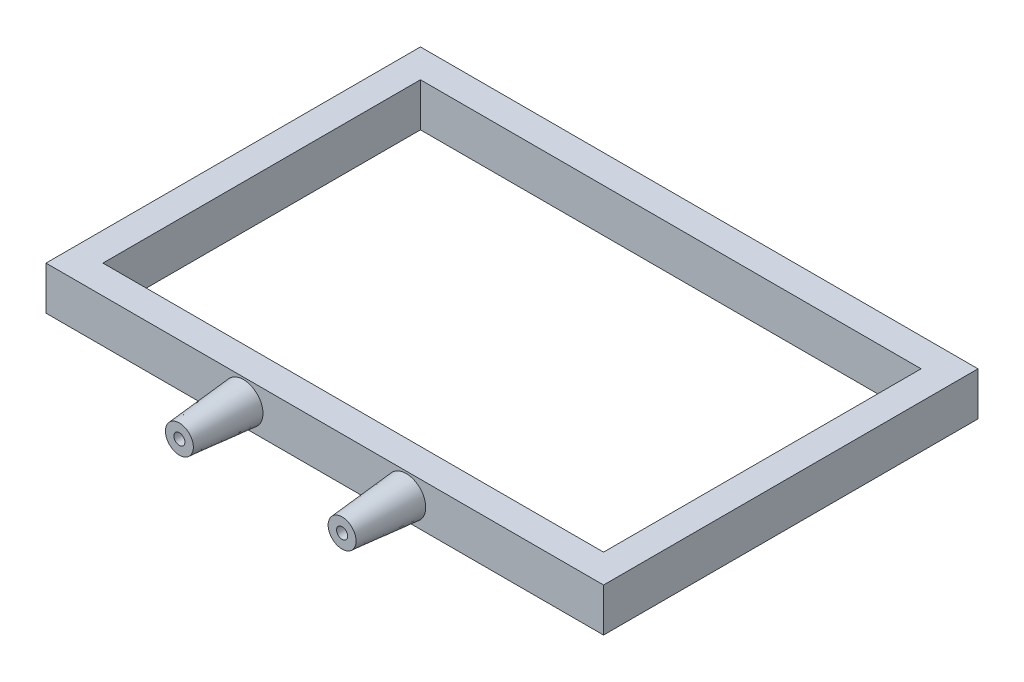
ISO-10303-21;
HEADER;
FILE_DESCRIPTION(('STEP AP214'),'2;1');
FILE_NAME('part.step','',(''),(''),'','','');
FILE_SCHEMA(('AUTOMOTIVE_DESIGN { 1 0 10303 214 1 1 1 1 }'));
ENDSEC;
DATA;
#1=APPLICATION_CONTEXT('core data for automotive mechanical design processes');
#2=APPLICATION_PROTOCOL_DEFINITION('international standard','automotive_design',2000,#1);
#3=PRODUCT_CONTEXT('',#1,'mechanical');
#4=PRODUCT('Part','Part','',(#3));
#5=PRODUCT_RELATED_PRODUCT_CATEGORY('part','',(#4));
#6=PRODUCT_DEFINITION_FORMATION('','',#4);
#7=PRODUCT_DEFINITION_CONTEXT('part definition',#1,'design');
#8=PRODUCT_DEFINITION('design','',#6,#7);
#9=PRODUCT_DEFINITION_SHAPE('','',#8);
#10=(LENGTH_UNIT() NAMED_UNIT(*) SI_UNIT(.MILLI.,.METRE.));
#11=(NAMED_UNIT(*) PLANE_ANGLE_UNIT() SI_UNIT($,.RADIAN.));
#12=(NAMED_UNIT(*) SI_UNIT($,.STERADIAN.) SOLID_ANGLE_UNIT());
#13=UNCERTAINTY_MEASURE_WITH_UNIT(LENGTH_MEASURE(1.E-05),#10,'distance_accuracy_value','');
#14=(GEOMETRIC_REPRESENTATION_CONTEXT(3) GLOBAL_UNCERTAINTY_ASSIGNED_CONTEXT((#13)) GLOBAL_UNIT_ASSIGNED_CONTEXT((#10,
#11,#12)) REPRESENTATION_CONTEXT('',''));
#15=CARTESIAN_POINT('',(0.,0.,0.));
#16=DIRECTION('',(0.,0.,1.));
#17=DIRECTION('',(1.,0.,0.));
#18=AXIS2_PLACEMENT_3D('',#15,#16,#17);
#19=CARTESIAN_POINT('',(-22.8749999999999,6.1,52.6359973136333));
#20=DIRECTION('',(0.,0.,-1.));
#21=DIRECTION('',(1.,0.,0.));
#22=AXIS2_PLACEMENT_3D('',#19,#20,#21);
#23=CONICAL_SURFACE('',#22,5.5,0.0872664625997165);
#24=CARTESIAN_POINT('',(-22.8749999999999,6.1,52.6359973136333));
#25=DIRECTION('',(0.,0.,-1.));
#26=DIRECTION('',(-1.,0.,0.));
#27=AXIS2_PLACEMENT_3D('',#24,#25,#26);
#28=CIRCLE('',#27,5.5);
#29=CARTESIAN_POINT('',(-28.3749999999999,6.1,52.6359973136333));
#30=VERTEX_POINT('',#29);
#31=EDGE_CURVE('E297',#30,#30,#28,.F.);
#32=ORIENTED_EDGE('',*,*,#31,.T.);
#33=EDGE_LOOP('',(#32));
#34=FACE_BOUND('',#33,.T.);
#35=CARTESIAN_POINT('',(-22.8749999999999,6.1,70.6359973136333));
#36=DIRECTION('',(0.,0.,1.));
#37=DIRECTION('',(1.,0.,0.));
#38=AXIS2_PLACEMENT_3D('',#35,#36,#37);
#39=CIRCLE('',#38,3.92520405653336);
#40=CARTESIAN_POINT('',(-18.9497959434666,6.1,70.6359973136333));
#41=VERTEX_POINT('',#40);
#42=EDGE_CURVE('E264',#41,#41,#39,.T.);
#43=ORIENTED_EDGE('',*,*,#42,.F.);
#44=EDGE_LOOP('',(#43));
#45=FACE_BOUND('',#44,.T.);
#46=CARTESIAN_POINT('',(-26.3749999999999,4.17210871809767,69.8285854690584));
#47=CARTESIAN_POINT('',(-26.3749999999999,4.11745942982969,69.5269976381816));
#48=CARTESIAN_POINT('',(-26.3749999999999,4.06446248035971,69.2251163527461));
#49=CARTESIAN_POINT('',(-26.3749999999999,3.96123087004707,68.6208892731655));
#50=CARTESIAN_POINT('',(-26.3749999999999,3.9109961356524,68.3185434916094));
#51=CARTESIAN_POINT('',(-26.3749999999999,3.81274798337831,67.7135200384658));
#52=CARTESIAN_POINT('',(-26.3749999999999,3.76473437277168,67.4108423980156));
#53=CARTESIAN_POINT('',(-26.3749999999999,3.67056684298433,66.8051961446706));
#54=CARTESIAN_POINT('',(-26.3749999999999,3.62441293829521,66.5022275295271));
#55=CARTESIAN_POINT('',(-26.3749999999999,3.48831477248816,65.5930914334059));
#56=CARTESIAN_POINT('',(-26.3749999999999,3.40071471504929,64.9865729981366));
#57=CARTESIAN_POINT('',(-26.3749999999999,3.23016743796715,63.7728702574676));
#58=CARTESIAN_POINT('',(-26.3749999999999,3.14722034779906,63.1656859340175));
#59=CARTESIAN_POINT('',(-26.3749999999999,2.98491601388755,61.950561728038));
#60=CARTESIAN_POINT('',(-26.3749999999999,2.90556039647342,61.3426216288001));
#61=CARTESIAN_POINT('',(-26.3749999999999,2.74975750285684,60.126368515576));
#62=CARTESIAN_POINT('',(-26.3749999999999,2.67331023423791,59.5180555006216));
#63=CARTESIAN_POINT('',(-26.3749999999999,2.44750949646066,57.6926767682325));
#64=CARTESIAN_POINT('',(-26.3749999999999,2.30169733858322,56.4751732114865));
#65=CARTESIAN_POINT('',(-26.3749999999999,2.01663971682371,54.0389161870429));
#66=CARTESIAN_POINT('',(-26.3749999999999,1.87739686896342,52.8201624156162));
#67=CARTESIAN_POINT('',(-26.3749999999999,1.67224553648955,50.9916372554584));
#68=CARTESIAN_POINT('',(-26.3749999999999,1.6044816752983,50.3820732311682));
#69=CARTESIAN_POINT('',(-26.3749999999999,1.47004371275973,49.162826215269));
#70=CARTESIAN_POINT('',(-26.3749999999999,1.40336960922725,48.5531432239012));
#71=CARTESIAN_POINT('',(-26.3749999999999,1.33716672483393,47.9434091582082));
#72=B_SPLINE_CURVE_WITH_KNOTS('',3,(#46,#47,#48,#49,#50,#51,#52,#53,#54,#55,#56,#57,#58,#59,#60,
#61,#62,#63,#64,#65,#66,#67,#68,#69,#70,#71),.UNSPECIFIED.,.F.,.F.,(4,2,2,2,2,2,2,2,2,2,2,2,4),
(0.,0.91948455837307,1.83894462092231,2.75832475157389,3.67771204503739,5.51611992035932,
7.3545789265392,9.19386227997452,11.0331504290127,14.7117323193549,18.3917669342644,
20.2317232111315,22.0716757980903),.UNSPECIFIED.);
#73=CARTESIAN_POINT('',(-26.3749999999999,2.81505393507992,60.6359973136333));
#74=VERTEX_POINT('',#73);
#75=CARTESIAN_POINT('',(-26.3749999999999,2.38189429319995,57.1359973136333));
#76=VERTEX_POINT('',#75);
#77=EDGE_CURVE('E11',#74,#76,#72,.T.);
#78=ORIENTED_EDGE('',*,*,#77,.F.);
#79=CARTESIAN_POINT('',(-22.8749999999999,6.1,60.6359973136333));
#80=DIRECTION('',(0.,0.,-1.));
#81=DIRECTION('',(-1.,0.,0.));
#82=AXIS2_PLACEMENT_3D('',#79,#80,#81);
#83=CIRCLE('',#82,4.8000906917926);
#84=CARTESIAN_POINT('',(-19.3749999999999,2.81505393507991,60.6359973136333));
#85=VERTEX_POINT('',#84);
#86=EDGE_CURVE('E236',#85,#74,#83,.T.);
#87=ORIENTED_EDGE('',*,*,#86,.F.);
#88=CARTESIAN_POINT('',(-19.3749999999999,1.33716672483392,47.9434091582082));
#89=CARTESIAN_POINT('',(-19.3749999999999,1.43500962840932,48.844351854817));
#90=CARTESIAN_POINT('',(-19.3749999999999,1.53384689658539,49.7451881265944));
#91=CARTESIAN_POINT('',(-19.3749999999999,1.73406321961327,51.5465669491305));
#92=CARTESIAN_POINT('',(-19.3749999999999,1.83544224393583,52.4471095032856));
#93=CARTESIAN_POINT('',(-19.3749999999999,2.04127619907767,54.2476556788387));
#94=CARTESIAN_POINT('',(-19.3749999999999,2.14573049022473,55.1476593731346));
#95=CARTESIAN_POINT('',(-19.3749999999999,2.35855843869986,56.9472195360648));
#96=CARTESIAN_POINT('',(-19.3749999999999,2.46693216248866,57.846775996853));
#97=CARTESIAN_POINT('',(-19.3749999999999,2.69205036720925,59.6720549838711));
#98=CARTESIAN_POINT('',(-19.3749999999999,2.80894803278661,60.5977587568576));
#99=CARTESIAN_POINT('',(-19.3749999999999,2.98981211234068,61.9855761544224));
#100=CARTESIAN_POINT('',(-19.3749999999999,3.0510184308723,62.4480494832672));
#101=CARTESIAN_POINT('',(-19.3749999999999,3.17564137614589,63.3727017550615));
#102=CARTESIAN_POINT('',(-19.3749999999999,3.23905801587242,63.8348806962655));
#103=CARTESIAN_POINT('',(-19.3749999999999,3.36858423900071,64.758971624193));
#104=CARTESIAN_POINT('',(-19.3749999999999,3.43469444400984,65.2208835240601));
#105=CARTESIAN_POINT('',(-19.3749999999999,3.57024116419512,66.1442126160202));
#106=CARTESIAN_POINT('',(-19.3749999999999,3.6396776245076,66.6056298161447));
#107=CARTESIAN_POINT('',(-19.3749999999999,3.78280263295804,67.5278740895825));
#108=CARTESIAN_POINT('',(-19.3749999999999,3.85649176054285,67.9887010736904));
#109=CARTESIAN_POINT('',(-19.3749999999999,3.97126229074893,68.6792510157885));
#110=CARTESIAN_POINT('',(-19.3749999999999,4.01022642101928,68.9093256550331));
#111=CARTESIAN_POINT('',(-19.3749999999999,4.08983772132458,69.3691868112572));
#112=CARTESIAN_POINT('',(-19.3749999999999,4.130484916852,69.5989733238181));
#113=CARTESIAN_POINT('',(-19.3749999999999,4.17210871809766,69.8285854690584));
#114=B_SPLINE_CURVE_WITH_KNOTS('',3,(#88,#89,#90,#91,#92,#93,#94,#95,#96,#97,#98,#99,#100,#101,
#102,#103,#104,#105,#106,#107,#108,#109,#110,#111,#112,#113),.UNSPECIFIED.,.F.,.F.,(4,2,2,2,2,2,
2,2,2,2,2,2,4),(0.,2.7187218020045,5.43741096484029,8.15553856620453,10.8737122797325,
13.6728538729671,15.0723675720148,16.4718894939034,17.8717362403286,19.2715599054532,
20.6715747558415,21.3716212738195,22.0716783989049),.UNSPECIFIED.);
#115=CARTESIAN_POINT('',(-19.3749999999999,2.38189429319994,57.1359973136333));
#116=VERTEX_POINT('',#115);
#117=EDGE_CURVE('E51',#116,#85,#114,.T.);
#118=ORIENTED_EDGE('',*,*,#117,.F.);
#119=CARTESIAN_POINT('',(-22.8749999999999,6.1,57.1359973136333));
#120=DIRECTION('',(0.,0.,1.));
#121=DIRECTION('',(1.,0.,0.));
#122=AXIS2_PLACEMENT_3D('',#119,#120,#121);
#123=CIRCLE('',#122,5.10630101413334);
#124=EDGE_CURVE('E233',#76,#116,#123,.T.);
#125=ORIENTED_EDGE('',*,*,#124,.F.);
#126=EDGE_LOOP('',(#78,#87,#118,#125));
#127=FACE_BOUND('',#126,.T.);
#128=ADVANCED_FACE('F37',(#34,#45,#127),#23,.T.);
#129=CARTESIAN_POINT('',(22.875,6.10000000000021,52.6359973136333));
#130=DIRECTION('',(0.,0.,-1.));
#131=DIRECTION('',(-1.,0.,0.));
#132=AXIS2_PLACEMENT_3D('',#129,#130,#131);
#133=CONICAL_SURFACE('',#132,5.5,0.0872664625997165);
#134=CARTESIAN_POINT('',(22.875,6.10000000000021,70.6359973136333));
#135=DIRECTION('',(0.,0.,-1.));
#136=DIRECTION('',(-1.,0.,0.));
#137=AXIS2_PLACEMENT_3D('',#134,#135,#136);
#138=CIRCLE('',#137,3.92520405653336);
#139=CARTESIAN_POINT('',(18.9497959434666,6.10000000000021,70.6359973136333));
#140=VERTEX_POINT('',#139);
#141=EDGE_CURVE('E254',#140,#140,#138,.T.);
#142=ORIENTED_EDGE('',*,*,#141,.T.);
#143=EDGE_LOOP('',(#142));
#144=FACE_BOUND('',#143,.T.);
#145=CARTESIAN_POINT('',(22.875,6.10000000000021,52.6359973136333));
#146=DIRECTION('',(0.,0.,-1.));
#147=DIRECTION('',(-1.,0.,0.));
#148=AXIS2_PLACEMENT_3D('',#145,#146,#147);
#149=CIRCLE('',#148,5.5);
#150=CARTESIAN_POINT('',(17.375,6.10000000000021,52.6359973136333));
#151=VERTEX_POINT('',#150);
#152=EDGE_CURVE('E261',#151,#151,#149,.T.);
#153=ORIENTED_EDGE('',*,*,#152,.F.);
#154=EDGE_LOOP('',(#153));
#155=FACE_BOUND('',#154,.T.);
#156=CARTESIAN_POINT('',(19.3749999999999,1.33716672483419,47.9434091582084));
#157=CARTESIAN_POINT('',(19.3749999999999,1.4350096284096,48.8443518548172));
#158=CARTESIAN_POINT('',(19.3749999999999,1.53384689658566,49.7451881265946));
#159=CARTESIAN_POINT('',(19.3749999999999,1.73406321961355,51.5465669491307));
#160=CARTESIAN_POINT('',(19.3749999999999,1.83544224393611,52.4471095032858));
#161=CARTESIAN_POINT('',(19.3749999999999,2.04127619907795,54.2476556788389));
#162=CARTESIAN_POINT('',(19.3749999999999,2.145730490225,55.1476593731347));
#163=CARTESIAN_POINT('',(19.3749999999999,2.35855843870014,56.9472195360649));
#164=CARTESIAN_POINT('',(19.3749999999999,2.46693216248894,57.8467759968532));
#165=CARTESIAN_POINT('',(19.3749999999999,2.69205036720953,59.6720549838712));
#166=CARTESIAN_POINT('',(19.3749999999999,2.80894803278689,60.5977587568577));
#167=CARTESIAN_POINT('',(19.3749999999999,2.98981211234096,61.9855761544225));
#168=CARTESIAN_POINT('',(19.3749999999999,3.05101843087257,62.4480494832672));
#169=CARTESIAN_POINT('',(19.3749999999999,3.17564137614617,63.3727017550616));
#170=CARTESIAN_POINT('',(19.3749999999999,3.2390580158727,63.8348806962656));
#171=CARTESIAN_POINT('',(19.3749999999999,3.36858423900098,64.758971624193));
#172=CARTESIAN_POINT('',(19.3749999999999,3.43469444401012,65.22088352406));
#173=CARTESIAN_POINT('',(19.3749999999999,3.5702411641954,66.1442126160201));
#174=CARTESIAN_POINT('',(19.3749999999999,3.63967762450788,66.6056298161446));
#175=CARTESIAN_POINT('',(19.3749999999999,3.78280263295832,67.5278740895824));
#176=CARTESIAN_POINT('',(19.3749999999999,3.85649176054313,67.9887010736903));
#177=CARTESIAN_POINT('',(19.3749999999999,3.97126229074921,68.6792510157883));
#178=CARTESIAN_POINT('',(19.3749999999999,4.01022642101956,68.909325655033));
#179=CARTESIAN_POINT('',(19.3749999999999,4.08983772132486,69.369186811257));
#180=CARTESIAN_POINT('',(19.3749999999999,4.13048491685228,69.598973323818));
#181=CARTESIAN_POINT('',(19.3749999999999,4.17210871809794,69.8285854690583));
#182=B_SPLINE_CURVE_WITH_KNOTS('',3,(#156,#157,#158,#159,#160,#161,#162,#163,#164,#165,#166,
#167,#168,#169,#170,#171,#172,#173,#174,#175,#176,#177,#178,#179,#180,#181),.UNSPECIFIED.,.F.,
.F.,(4,2,2,2,2,2,2,2,2,2,2,2,4),(0.,2.7187218020045,5.43741096484028,8.1555385662045,
10.8737122797325,13.672853872967,15.0723675720146,16.4718894939032,17.8717362403284,
19.2715599054529,20.6715747558411,21.3716212738192,22.0716783989045),.UNSPECIFIED.);
#183=CARTESIAN_POINT('',(19.3749999999999,2.3818942932002,57.1359973136333));
#184=VERTEX_POINT('',#183);
#185=CARTESIAN_POINT('',(19.3749999999999,2.81505393508006,60.6359973136334));
#186=VERTEX_POINT('',#185);
#187=EDGE_CURVE('E300',#184,#186,#182,.T.);
#188=ORIENTED_EDGE('',*,*,#187,.T.);
#189=CARTESIAN_POINT('',(22.875,6.10000000000021,60.6359973136333));
#190=DIRECTION('',(0.,0.,-1.));
#191=DIRECTION('',(-1.,0.,0.));
#192=AXIS2_PLACEMENT_3D('',#189,#190,#191);
#193=CIRCLE('',#192,4.8000906917926);
#194=CARTESIAN_POINT('',(26.3749999999999,2.81505393508006,60.6359973136333));
#195=VERTEX_POINT('',#194);
#196=EDGE_CURVE('E243',#186,#195,#193,.F.);
#197=ORIENTED_EDGE('',*,*,#196,.T.);
#198=CARTESIAN_POINT('',(26.3749999999999,4.17210871809775,69.8285854690582));
#199=CARTESIAN_POINT('',(26.3749999999999,4.11745942982977,69.5269976381814));
#200=CARTESIAN_POINT('',(26.3749999999999,4.06446248035979,69.2251163527459));
#201=CARTESIAN_POINT('',(26.3749999999999,3.96123087004716,68.6208892731653));
#202=CARTESIAN_POINT('',(26.3749999999999,3.91099613565249,68.3185434916092));
#203=CARTESIAN_POINT('',(26.3749999999999,3.8127479833784,67.7135200384656));
#204=CARTESIAN_POINT('',(26.3749999999999,3.76473437277178,67.4108423980154));
#205=CARTESIAN_POINT('',(26.3749999999999,3.67056684298443,66.8051961446704));
#206=CARTESIAN_POINT('',(26.3749999999999,3.62441293829532,66.5022275295269));
#207=CARTESIAN_POINT('',(26.3749999999999,3.48831477248826,65.5930914334057));
#208=CARTESIAN_POINT('',(26.3749999999999,3.40071471504939,64.9865729981364));
#209=CARTESIAN_POINT('',(26.3749999999999,3.23016743796727,63.7728702574674));
#210=CARTESIAN_POINT('',(26.3749999999999,3.14722034779917,63.1656859340173));
#211=CARTESIAN_POINT('',(26.3749999999999,2.98491601388767,61.9505617280378));
#212=CARTESIAN_POINT('',(26.3749999999999,2.90556039647355,61.3426216287999));
#213=CARTESIAN_POINT('',(26.3749999999999,2.74975750285697,60.1263685155759));
#214=CARTESIAN_POINT('',(26.3749999999999,2.67331023423804,59.5180555006215));
#215=CARTESIAN_POINT('',(26.3749999999999,2.4475094964608,57.6926767682324));
#216=CARTESIAN_POINT('',(26.3749999999999,2.30169733858338,56.4751732114864));
#217=CARTESIAN_POINT('',(26.3749999999999,2.01663971682388,54.0389161870429));
#218=CARTESIAN_POINT('',(26.3749999999999,1.87739686896359,52.8201624156163));
#219=CARTESIAN_POINT('',(26.3749999999999,1.67224553648973,50.9916372554585));
#220=CARTESIAN_POINT('',(26.3749999999999,1.60448167529848,50.3820732311683));
#221=CARTESIAN_POINT('',(26.3749999999999,1.47004371275992,49.1628262152692));
#222=CARTESIAN_POINT('',(26.3749999999999,1.40336960922744,48.5531432239014));
#223=CARTESIAN_POINT('',(26.3749999999999,1.33716672483412,47.9434091582084));
#224=B_SPLINE_CURVE_WITH_KNOTS('',3,(#198,#199,#200,#201,#202,#203,#204,#205,#206,#207,#208,
#209,#210,#211,#212,#213,#214,#215,#216,#217,#218,#219,#220,#221,#222,#223),.UNSPECIFIED.,.F.,
.F.,(4,2,2,2,2,2,2,2,2,2,2,2,4),(0.,0.919484558373068,1.8389446209223,2.7583247515739,
3.67771204503739,5.51611992035932,7.35457892653922,9.19386227997449,11.0331504290126,
14.7117323193547,18.3917669342641,20.2317232111311,22.0716757980899),.UNSPECIFIED.);
#225=CARTESIAN_POINT('',(26.3749999999999,2.38189429320011,57.1359973136333));
#226=VERTEX_POINT('',#225);
#227=EDGE_CURVE('E317',#195,#226,#224,.T.);
#228=ORIENTED_EDGE('',*,*,#227,.T.);
#229=CARTESIAN_POINT('',(22.875,6.10000000000021,57.1359973136333));
#230=DIRECTION('',(0.,0.,1.));
#231=DIRECTION('',(1.,0.,0.));
#232=AXIS2_PLACEMENT_3D('',#229,#230,#231);
#233=CIRCLE('',#232,5.10630101413334);
#234=EDGE_CURVE('E239',#226,#184,#233,.F.);
#235=ORIENTED_EDGE('',*,*,#234,.T.);
#236=EDGE_LOOP('',(#188,#197,#228,#235));
#237=FACE_BOUND('',#236,.T.);
#238=ADVANCED_FACE('F323',(#144,#155,#237),#133,.T.);
#239=CARTESIAN_POINT('',(22.8750000000001,6.1,70.6369973136333));
#240=DIRECTION('',(0.,0.,-1.));
#241=DIRECTION('',(-1.,0.,0.));
#242=AXIS2_PLACEMENT_3D('',#239,#240,#241);
#243=CYLINDRICAL_SURFACE('',#242,1.55);
#244=CARTESIAN_POINT('',(22.8750000000001,6.1,70.6359973136333));
#245=DIRECTION('',(0.,0.,-1.));
#246=DIRECTION('',(-1.,0.,0.));
#247=AXIS2_PLACEMENT_3D('',#244,#245,#246);
#248=CIRCLE('',#247,1.55);
#249=CARTESIAN_POINT('',(21.3250000000001,6.1,70.6359973136333));
#250=VERTEX_POINT('',#249);
#251=EDGE_CURVE('E246',#250,#250,#248,.T.);
#252=ORIENTED_EDGE('',*,*,#251,.F.);
#253=EDGE_LOOP('',(#252));
#254=FACE_BOUND('',#253,.T.);
#255=CARTESIAN_POINT('',(22.8750000000001,6.1,60.6359973136333));
#256=DIRECTION('',(0.,0.,-1.));
#257=DIRECTION('',(-1.,0.,0.));
#258=AXIS2_PLACEMENT_3D('',#255,#256,#257);
#259=CIRCLE('',#258,1.55);
#260=CARTESIAN_POINT('',(21.3250000000001,6.1,60.6359973136333));
#261=VERTEX_POINT('',#260);
#262=EDGE_CURVE('E242',#261,#261,#259,.T.);
#263=ORIENTED_EDGE('',*,*,#262,.T.);
#264=EDGE_LOOP('',(#263));
#265=FACE_BOUND('',#264,.T.);
#266=ADVANCED_FACE('F355',(#254,#265),#243,.F.);
#267=CARTESIAN_POINT('',(-22.8749999999999,6.1,70.6369973136333));
#268=DIRECTION('',(0.,0.,-1.));
#269=DIRECTION('',(-1.,0.,0.));
#270=AXIS2_PLACEMENT_3D('',#267,#268,#269);
#271=CYLINDRICAL_SURFACE('',#270,1.55);
#272=CARTESIAN_POINT('',(-22.8749999999999,6.1,70.6359973136333));
#273=DIRECTION('',(0.,0.,1.));
#274=DIRECTION('',(1.,0.,0.));
#275=AXIS2_PLACEMENT_3D('',#272,#273,#274);
#276=CIRCLE('',#275,1.55);
#277=CARTESIAN_POINT('',(-21.3249999999999,6.1,70.6359973136333));
#278=VERTEX_POINT('',#277);
#279=EDGE_CURVE('E250',#278,#278,#276,.T.);
#280=ORIENTED_EDGE('',*,*,#279,.T.);
#281=EDGE_LOOP('',(#280));
#282=FACE_BOUND('',#281,.T.);
#283=CARTESIAN_POINT('',(-22.8749999999999,6.1,60.6359973136333));
#284=DIRECTION('',(0.,0.,-1.));
#285=DIRECTION('',(-1.,0.,0.));
#286=AXIS2_PLACEMENT_3D('',#283,#284,#285);
#287=CIRCLE('',#286,1.55);
#288=CARTESIAN_POINT('',(-24.4249999999999,6.1,60.6359973136333));
#289=VERTEX_POINT('',#288);
#290=EDGE_CURVE('E235',#289,#289,#287,.T.);
#291=ORIENTED_EDGE('',*,*,#290,.T.);
#292=EDGE_LOOP('',(#291));
#293=FACE_BOUND('',#292,.T.);
#294=ADVANCED_FACE('F352',(#282,#293),#271,.F.);
#295=CARTESIAN_POINT('',(0.,12.2,0.));
#296=DIRECTION('',(0.,1.,0.));
#297=DIRECTION('',(0.,0.,1.));
#298=AXIS2_PLACEMENT_3D('',#295,#296,#297);
#299=PLANE('',#298);
#300=DIRECTION('',(0.,0.,-1.));
#301=VECTOR('',#300,1.);
#302=CARTESIAN_POINT('',(-70.375,12.2,-44.6359973136333));
#303=LINE('',#302,#301);
#304=CARTESIAN_POINT('',(-70.375,12.2,44.6359973136333));
#305=VERTEX_POINT('',#304);
#306=CARTESIAN_POINT('',(-70.375,12.2,-44.6359973136333));
#307=VERTEX_POINT('',#306);
#308=EDGE_CURVE('E158',#305,#307,#303,.T.);
#309=ORIENTED_EDGE('',*,*,#308,.T.);
#310=DIRECTION('',(1.,0.,0.));
#311=VECTOR('',#310,1.);
#312=CARTESIAN_POINT('',(70.375,12.2,-44.6359973136333));
#313=LINE('',#312,#311);
#314=CARTESIAN_POINT('',(70.375,12.2,-44.6359973136333));
#315=VERTEX_POINT('',#314);
#316=EDGE_CURVE('E167',#307,#315,#313,.T.);
#317=ORIENTED_EDGE('',*,*,#316,.T.);
#318=DIRECTION('',(0.,0.,1.));
#319=VECTOR('',#318,1.);
#320=CARTESIAN_POINT('',(70.375,12.2,-44.6359973136333));
#321=LINE('',#320,#319);
#322=CARTESIAN_POINT('',(70.3749999999999,12.2,44.6359973136333));
#323=VERTEX_POINT('',#322);
#324=EDGE_CURVE('E58',#315,#323,#321,.T.);
#325=ORIENTED_EDGE('',*,*,#324,.T.);
#326=DIRECTION('',(-1.,0.,0.));
#327=VECTOR('',#326,1.);
#328=CARTESIAN_POINT('',(70.3749999999999,12.2,44.6359973136333));
#329=LINE('',#328,#327);
#330=EDGE_CURVE('E164',#323,#305,#329,.T.);
#331=ORIENTED_EDGE('',*,*,#330,.T.);
#332=EDGE_LOOP('',(#309,#317,#325,#331));
#333=FACE_BOUND('',#332,.T.);
#334=DIRECTION('',(0.,0.,-1.));
#335=VECTOR('',#334,1.);
#336=CARTESIAN_POINT('',(78.375,12.2,-52.6359973136333));
#337=LINE('',#336,#335);
#338=CARTESIAN_POINT('',(78.3750000000001,12.2,52.6359973136333));
#339=VERTEX_POINT('',#338);
#340=CARTESIAN_POINT('',(78.375,12.2,-52.6359973136333));
#341=VERTEX_POINT('',#340);
#342=EDGE_CURVE('E268',#339,#341,#337,.T.);
#343=ORIENTED_EDGE('',*,*,#342,.T.);
#344=DIRECTION('',(-1.,0.,0.));
#345=VECTOR('',#344,1.);
#346=CARTESIAN_POINT('',(-78.375,12.2,-52.6359973136333));
#347=LINE('',#346,#345);
#348=CARTESIAN_POINT('',(-78.375,12.2,-52.6359973136333));
#349=VERTEX_POINT('',#348);
#350=EDGE_CURVE('E271',#341,#349,#347,.T.);
#351=ORIENTED_EDGE('',*,*,#350,.T.);
#352=DIRECTION('',(0.,0.,1.));
#353=VECTOR('',#352,1.);
#354=CARTESIAN_POINT('',(-78.375,12.2,-52.6359973136333));
#355=LINE('',#354,#353);
#356=CARTESIAN_POINT('',(-78.3749999999999,12.2,52.6359973136333));
#357=VERTEX_POINT('',#356);
#358=EDGE_CURVE('E274',#349,#357,#355,.T.);
#359=ORIENTED_EDGE('',*,*,#358,.T.);
#360=DIRECTION('',(1.,0.,0.));
#361=VECTOR('',#360,1.);
#362=CARTESIAN_POINT('',(-78.3749999999999,12.2,52.6359973136333));
#363=LINE('',#362,#361);
#364=EDGE_CURVE('E276',#357,#339,#363,.T.);
#365=ORIENTED_EDGE('',*,*,#364,.T.);
#366=EDGE_LOOP('',(#343,#351,#359,#365));
#367=FACE_BOUND('',#366,.T.);
#368=ADVANCED_FACE('F171',(#333,#367),#299,.T.);
#369=CARTESIAN_POINT('',(78.375,12.2,-52.6359973136333));
#370=DIRECTION('',(-1.,0.,0.));
#371=DIRECTION('',(0.,0.,1.));
#372=AXIS2_PLACEMENT_3D('',#369,#370,#371);
#373=PLANE('',#372);
#374=DIRECTION('',(0.,0.,-1.));
#375=VECTOR('',#374,1.);
#376=CARTESIAN_POINT('',(78.375,0.,-52.6359973136333));
#377=LINE('',#376,#375);
#378=CARTESIAN_POINT('',(78.3750000000001,0.,52.6359973136333));
#379=VERTEX_POINT('',#378);
#380=CARTESIAN_POINT('',(78.375,0.,-52.6359973136333));
#381=VERTEX_POINT('',#380);
#382=EDGE_CURVE('E267',#379,#381,#377,.T.);
#383=ORIENTED_EDGE('',*,*,#382,.T.);
#384=DIRECTION('',(0.,-1.,0.));
#385=VECTOR('',#384,1.);
#386=CARTESIAN_POINT('',(78.375,12.2,-52.6359973136333));
#387=LINE('',#386,#385);
#388=EDGE_CURVE('E294',#341,#381,#387,.T.);
#389=ORIENTED_EDGE('',*,*,#388,.F.);
#390=ORIENTED_EDGE('',*,*,#342,.F.);
#391=DIRECTION('',(0.,-1.,0.));
#392=VECTOR('',#391,1.);
#393=CARTESIAN_POINT('',(78.3750000000001,12.2,52.6359973136333));
#394=LINE('',#393,#392);
#395=EDGE_CURVE('E278',#339,#379,#394,.T.);
#396=ORIENTED_EDGE('',*,*,#395,.T.);
#397=EDGE_LOOP('',(#383,#389,#390,#396));
#398=FACE_BOUND('',#397,.T.);
#399=ADVANCED_FACE('F39',(#398),#373,.F.);
#400=CARTESIAN_POINT('',(-78.375,12.2,-52.6359973136333));
#401=DIRECTION('',(0.,0.,1.));
#402=DIRECTION('',(1.,0.,0.));
#403=AXIS2_PLACEMENT_3D('',#400,#401,#402);
#404=PLANE('',#403);
#405=DIRECTION('',(-1.,0.,0.));
#406=VECTOR('',#405,1.);
#407=CARTESIAN_POINT('',(-78.375,0.,-52.6359973136333));
#408=LINE('',#407,#406);
#409=CARTESIAN_POINT('',(-78.375,0.,-52.6359973136333));
#410=VERTEX_POINT('',#409);
#411=EDGE_CURVE('E281',#381,#410,#408,.T.);
#412=ORIENTED_EDGE('',*,*,#411,.T.);
#413=DIRECTION('',(0.,-1.,0.));
#414=VECTOR('',#413,1.);
#415=CARTESIAN_POINT('',(-78.375,12.2,-52.6359973136333));
#416=LINE('',#415,#414);
#417=EDGE_CURVE('E291',#349,#410,#416,.T.);
#418=ORIENTED_EDGE('',*,*,#417,.F.);
#419=ORIENTED_EDGE('',*,*,#350,.F.);
#420=ORIENTED_EDGE('',*,*,#388,.T.);
#421=EDGE_LOOP('',(#412,#418,#419,#420));
#422=FACE_BOUND('',#421,.T.);
#423=ADVANCED_FACE('F464',(#422),#404,.F.);
#424=CARTESIAN_POINT('',(-78.375,12.2,-52.6359973136333));
#425=DIRECTION('',(1.,0.,0.));
#426=DIRECTION('',(0.,0.,-1.));
#427=AXIS2_PLACEMENT_3D('',#424,#425,#426);
#428=PLANE('',#427);
#429=DIRECTION('',(0.,0.,1.));
#430=VECTOR('',#429,1.);
#431=CARTESIAN_POINT('',(-78.375,0.,-52.6359973136333));
#432=LINE('',#431,#430);
#433=CARTESIAN_POINT('',(-78.3749999999999,0.,52.6359973136333));
#434=VERTEX_POINT('',#433);
#435=EDGE_CURVE('E283',#410,#434,#432,.T.);
#436=ORIENTED_EDGE('',*,*,#435,.T.);
#437=DIRECTION('',(0.,-1.,0.));
#438=VECTOR('',#437,1.);
#439=CARTESIAN_POINT('',(-78.3749999999999,12.2,52.6359973136333));
#440=LINE('',#439,#438);
#441=EDGE_CURVE('E288',#357,#434,#440,.T.);
#442=ORIENTED_EDGE('',*,*,#441,.F.);
#443=ORIENTED_EDGE('',*,*,#358,.F.);
#444=ORIENTED_EDGE('',*,*,#417,.T.);
#445=EDGE_LOOP('',(#436,#442,#443,#444));
#446=FACE_BOUND('',#445,.T.);
#447=ADVANCED_FACE('F461',(#446),#428,.F.);
#448=CARTESIAN_POINT('',(-78.3749999999999,12.2,52.6359973136333));
#449=DIRECTION('',(0.,0.,-1.));
#450=DIRECTION('',(-1.,0.,0.));
#451=AXIS2_PLACEMENT_3D('',#448,#449,#450);
#452=PLANE('',#451);
#453=ORIENTED_EDGE('',*,*,#152,.T.);
#454=EDGE_LOOP('',(#453));
#455=FACE_BOUND('',#454,.T.);
#456=ORIENTED_EDGE('',*,*,#31,.F.);
#457=EDGE_LOOP('',(#456));
#458=FACE_BOUND('',#457,.T.);
#459=DIRECTION('',(1.,0.,0.));
#460=VECTOR('',#459,1.);
#461=CARTESIAN_POINT('',(-78.3749999999999,0.,52.6359973136333));
#462=LINE('',#461,#460);
#463=EDGE_CURVE('E272',#434,#379,#462,.T.);
#464=ORIENTED_EDGE('',*,*,#463,.T.);
#465=ORIENTED_EDGE('',*,*,#395,.F.);
#466=ORIENTED_EDGE('',*,*,#364,.F.);
#467=ORIENTED_EDGE('',*,*,#441,.T.);
#468=EDGE_LOOP('',(#464,#465,#466,#467));
#469=FACE_BOUND('',#468,.T.);
#470=ADVANCED_FACE('F448',(#455,#458,#469),#452,.F.);
#471=CARTESIAN_POINT('',(0.,0.,0.));
#472=DIRECTION('',(0.,1.,0.));
#473=DIRECTION('',(0.,0.,1.));
#474=AXIS2_PLACEMENT_3D('',#471,#472,#473);
#475=PLANE('',#474);
#476=DIRECTION('',(1.,0.,0.));
#477=VECTOR('',#476,1.);
#478=CARTESIAN_POINT('',(70.375,0.,-44.6359973136333));
#479=LINE('',#478,#477);
#480=CARTESIAN_POINT('',(-70.375,0.,-44.6359973136333));
#481=VERTEX_POINT('',#480);
#482=CARTESIAN_POINT('',(70.375,0.,-44.6359973136333));
#483=VERTEX_POINT('',#482);
#484=EDGE_CURVE('E183',#481,#483,#479,.T.);
#485=ORIENTED_EDGE('',*,*,#484,.F.);
#486=DIRECTION('',(0.,0.,-1.));
#487=VECTOR('',#486,1.);
#488=CARTESIAN_POINT('',(-70.375,0.,-44.6359973136333));
#489=LINE('',#488,#487);
#490=CARTESIAN_POINT('',(-70.375,0.,44.6359973136333));
#491=VERTEX_POINT('',#490);
#492=EDGE_CURVE('E66',#491,#481,#489,.T.);
#493=ORIENTED_EDGE('',*,*,#492,.F.);
#494=DIRECTION('',(-1.,0.,0.));
#495=VECTOR('',#494,1.);
#496=CARTESIAN_POINT('',(70.3749999999999,0.,44.6359973136333));
#497=LINE('',#496,#495);
#498=CARTESIAN_POINT('',(70.3749999999999,0.,44.6359973136333));
#499=VERTEX_POINT('',#498);
#500=EDGE_CURVE('E174',#499,#491,#497,.T.);
#501=ORIENTED_EDGE('',*,*,#500,.F.);
#502=DIRECTION('',(0.,0.,1.));
#503=VECTOR('',#502,1.);
#504=CARTESIAN_POINT('',(70.375,0.,-44.6359973136333));
#505=LINE('',#504,#503);
#506=EDGE_CURVE('E177',#483,#499,#505,.T.);
#507=ORIENTED_EDGE('',*,*,#506,.F.);
#508=EDGE_LOOP('',(#485,#493,#501,#507));
#509=FACE_BOUND('',#508,.T.);
#510=ORIENTED_EDGE('',*,*,#382,.F.);
#511=ORIENTED_EDGE('',*,*,#463,.F.);
#512=ORIENTED_EDGE('',*,*,#435,.F.);
#513=ORIENTED_EDGE('',*,*,#411,.F.);
#514=EDGE_LOOP('',(#510,#511,#512,#513));
#515=FACE_BOUND('',#514,.T.);
#516=ADVANCED_FACE('F445',(#509,#515),#475,.F.);
#517=CARTESIAN_POINT('',(-22.8749999999999,6.1,70.6359973136333));
#518=DIRECTION('',(0.,0.,1.));
#519=DIRECTION('',(1.,0.,0.));
#520=AXIS2_PLACEMENT_3D('',#517,#518,#519);
#521=PLANE('',#520);
#522=ORIENTED_EDGE('',*,*,#279,.F.);
#523=EDGE_LOOP('',(#522));
#524=FACE_BOUND('',#523,.T.);
#525=ORIENTED_EDGE('',*,*,#42,.T.);
#526=EDGE_LOOP('',(#525));
#527=FACE_BOUND('',#526,.T.);
#528=ADVANCED_FACE('F381',(#524,#527),#521,.T.);
#529=CARTESIAN_POINT('',(22.875,6.10000000000021,70.6359973136333));
#530=DIRECTION('',(0.,0.,-1.));
#531=DIRECTION('',(-1.,0.,0.));
#532=AXIS2_PLACEMENT_3D('',#529,#530,#531);
#533=PLANE('',#532);
#534=ORIENTED_EDGE('',*,*,#251,.T.);
#535=EDGE_LOOP('',(#534));
#536=FACE_BOUND('',#535,.T.);
#537=ORIENTED_EDGE('',*,*,#141,.F.);
#538=EDGE_LOOP('',(#537));
#539=FACE_BOUND('',#538,.T.);
#540=ADVANCED_FACE('F403',(#536,#539),#533,.F.);
#541=CARTESIAN_POINT('',(-26.3749999999999,9.1,60.6359973136333));
#542=DIRECTION('',(1.,0.,0.));
#543=DIRECTION('',(0.,0.,-1.));
#544=AXIS2_PLACEMENT_3D('',#541,#542,#543);
#545=PLANE('',#544);
#546=ORIENTED_EDGE('',*,*,#77,.T.);
#547=DIRECTION('',(0.,-1.,0.));
#548=VECTOR('',#547,1.);
#549=CARTESIAN_POINT('',(-26.3749999999999,9.1,57.1359973136333));
#550=LINE('',#549,#548);
#551=CARTESIAN_POINT('',(-26.3749999999999,9.1,57.1359973136333));
#552=VERTEX_POINT('',#551);
#553=EDGE_CURVE('E203',#552,#76,#550,.T.);
#554=ORIENTED_EDGE('',*,*,#553,.F.);
#555=DIRECTION('',(0.,0.,1.));
#556=VECTOR('',#555,1.);
#557=CARTESIAN_POINT('',(-26.3749999999999,9.1,60.6359973136333));
#558=LINE('',#557,#556);
#559=CARTESIAN_POINT('',(-26.3749999999999,9.1,60.6359973136333));
#560=VERTEX_POINT('',#559);
#561=EDGE_CURVE('E193',#552,#560,#558,.T.);
#562=ORIENTED_EDGE('',*,*,#561,.T.);
#563=DIRECTION('',(0.,-1.,0.));
#564=VECTOR('',#563,1.);
#565=CARTESIAN_POINT('',(-26.3749999999999,9.1,60.6359973136333));
#566=LINE('',#565,#564);
#567=EDGE_CURVE('E211',#560,#74,#566,.T.);
#568=ORIENTED_EDGE('',*,*,#567,.T.);
#569=EDGE_LOOP('',(#546,#554,#562,#568));
#570=FACE_BOUND('',#569,.T.);
#571=ADVANCED_FACE('F395',(#570),#545,.T.);
#572=CARTESIAN_POINT('',(-19.3749999999999,9.1,60.6359973136333));
#573=DIRECTION('',(-1.,0.,0.));
#574=DIRECTION('',(0.,0.,1.));
#575=AXIS2_PLACEMENT_3D('',#572,#573,#574);
#576=PLANE('',#575);
#577=ORIENTED_EDGE('',*,*,#117,.T.);
#578=DIRECTION('',(0.,-1.,0.));
#579=VECTOR('',#578,1.);
#580=CARTESIAN_POINT('',(-19.3749999999999,9.1,60.6359973136333));
#581=LINE('',#580,#579);
#582=CARTESIAN_POINT('',(-19.3749999999999,9.1,60.6359973136333));
#583=VERTEX_POINT('',#582);
#584=EDGE_CURVE('E208',#583,#85,#581,.T.);
#585=ORIENTED_EDGE('',*,*,#584,.F.);
#586=DIRECTION('',(0.,0.,-1.));
#587=VECTOR('',#586,1.);
#588=CARTESIAN_POINT('',(-19.3749999999999,9.1,60.6359973136333));
#589=LINE('',#588,#587);
#590=CARTESIAN_POINT('',(-19.3749999999999,9.1,57.1359973136333));
#591=VERTEX_POINT('',#590);
#592=EDGE_CURVE('E199',#583,#591,#589,.T.);
#593=ORIENTED_EDGE('',*,*,#592,.T.);
#594=DIRECTION('',(0.,-1.,0.));
#595=VECTOR('',#594,1.);
#596=CARTESIAN_POINT('',(-19.3749999999999,9.1,57.1359973136333));
#597=LINE('',#596,#595);
#598=EDGE_CURVE('E205',#591,#116,#597,.T.);
#599=ORIENTED_EDGE('',*,*,#598,.T.);
#600=EDGE_LOOP('',(#577,#585,#593,#599));
#601=FACE_BOUND('',#600,.T.);
#602=ADVANCED_FACE('F389',(#601),#576,.T.);
#603=CARTESIAN_POINT('',(-26.3749999999999,9.1,60.6359973136333));
#604=DIRECTION('',(0.,0.,-1.));
#605=DIRECTION('',(-1.,0.,0.));
#606=AXIS2_PLACEMENT_3D('',#603,#604,#605);
#607=PLANE('',#606);
#608=ORIENTED_EDGE('',*,*,#290,.F.);
#609=EDGE_LOOP('',(#608));
#610=FACE_BOUND('',#609,.T.);
#611=ORIENTED_EDGE('',*,*,#86,.T.);
#612=ORIENTED_EDGE('',*,*,#567,.F.);
#613=DIRECTION('',(1.,0.,0.));
#614=VECTOR('',#613,1.);
#615=CARTESIAN_POINT('',(-26.3749999999999,9.1,60.6359973136333));
#616=LINE('',#615,#614);
#617=EDGE_CURVE('E196',#560,#583,#616,.T.);
#618=ORIENTED_EDGE('',*,*,#617,.T.);
#619=ORIENTED_EDGE('',*,*,#584,.T.);
#620=EDGE_LOOP('',(#611,#612,#618,#619));
#621=FACE_BOUND('',#620,.T.);
#622=ADVANCED_FACE('F394',(#610,#621),#607,.T.);
#623=CARTESIAN_POINT('',(-26.3749999999999,9.1,57.1359973136333));
#624=DIRECTION('',(0.,0.,1.));
#625=DIRECTION('',(1.,0.,0.));
#626=AXIS2_PLACEMENT_3D('',#623,#624,#625);
#627=PLANE('',#626);
#628=CARTESIAN_POINT('',(-22.8749999999999,6.1,57.1359973136333));
#629=DIRECTION('',(0.,0.,1.));
#630=DIRECTION('',(1.,0.,0.));
#631=AXIS2_PLACEMENT_3D('',#628,#629,#630);
#632=CIRCLE('',#631,1.55);
#633=CARTESIAN_POINT('',(-21.3249999999999,6.1,57.1359973136333));
#634=VERTEX_POINT('',#633);
#635=EDGE_CURVE('E214',#634,#634,#632,.T.);
#636=ORIENTED_EDGE('',*,*,#635,.F.);
#637=EDGE_LOOP('',(#636));
#638=FACE_BOUND('',#637,.T.);
#639=ORIENTED_EDGE('',*,*,#124,.T.);
#640=ORIENTED_EDGE('',*,*,#598,.F.);
#641=DIRECTION('',(-1.,0.,0.));
#642=VECTOR('',#641,1.);
#643=CARTESIAN_POINT('',(-26.3749999999999,9.1,57.1359973136333));
#644=LINE('',#643,#642);
#645=EDGE_CURVE('E201',#591,#552,#644,.T.);
#646=ORIENTED_EDGE('',*,*,#645,.T.);
#647=ORIENTED_EDGE('',*,*,#553,.T.);
#648=EDGE_LOOP('',(#639,#640,#646,#647));
#649=FACE_BOUND('',#648,.T.);
#650=ADVANCED_FACE('F397',(#638,#649),#627,.T.);
#651=CARTESIAN_POINT('',(0.,9.1,0.));
#652=DIRECTION('',(0.,-1.,0.));
#653=DIRECTION('',(0.,0.,-1.));
#654=AXIS2_PLACEMENT_3D('',#651,#652,#653);
#655=PLANE('',#654);
#656=ORIENTED_EDGE('',*,*,#561,.F.);
#657=ORIENTED_EDGE('',*,*,#645,.F.);
#658=ORIENTED_EDGE('',*,*,#592,.F.);
#659=ORIENTED_EDGE('',*,*,#617,.F.);
#660=EDGE_LOOP('',(#656,#657,#658,#659));
#661=FACE_BOUND('',#660,.T.);
#662=ADVANCED_FACE('F345',(#661),#655,.T.);
#663=CARTESIAN_POINT('',(26.3749999999999,9.1,60.6359973136333));
#664=DIRECTION('',(0.,0.,-1.));
#665=DIRECTION('',(-1.,0.,0.));
#666=AXIS2_PLACEMENT_3D('',#663,#664,#665);
#667=PLANE('',#666);
#668=ORIENTED_EDGE('',*,*,#262,.F.);
#669=EDGE_LOOP('',(#668));
#670=FACE_BOUND('',#669,.T.);
#671=DIRECTION('',(0.,-1.,0.));
#672=VECTOR('',#671,1.);
#673=CARTESIAN_POINT('',(19.3749999999999,9.1,60.6359973136333));
#674=LINE('',#673,#672);
#675=CARTESIAN_POINT('',(19.3749999999999,9.1,60.6359973136333));
#676=VERTEX_POINT('',#675);
#677=EDGE_CURVE('E223',#676,#186,#674,.T.);
#678=ORIENTED_EDGE('',*,*,#677,.F.);
#679=DIRECTION('',(1.,0.,0.));
#680=VECTOR('',#679,1.);
#681=CARTESIAN_POINT('',(26.3749999999999,9.1,60.6359973136333));
#682=LINE('',#681,#680);
#683=CARTESIAN_POINT('',(26.3749999999999,9.1,60.6359973136333));
#684=VERTEX_POINT('',#683);
#685=EDGE_CURVE('E189',#676,#684,#682,.T.);
#686=ORIENTED_EDGE('',*,*,#685,.T.);
#687=DIRECTION('',(0.,-1.,0.));
#688=VECTOR('',#687,1.);
#689=CARTESIAN_POINT('',(26.3749999999999,9.1,60.6359973136333));
#690=LINE('',#689,#688);
#691=EDGE_CURVE('E197',#684,#195,#690,.T.);
#692=ORIENTED_EDGE('',*,*,#691,.T.);
#693=ORIENTED_EDGE('',*,*,#196,.F.);
#694=EDGE_LOOP('',(#678,#686,#692,#693));
#695=FACE_BOUND('',#694,.T.);
#696=ADVANCED_FACE('F341',(#670,#695),#667,.T.);
#697=CARTESIAN_POINT('',(26.3749999999999,9.1,60.6359973136333));
#698=DIRECTION('',(-1.,0.,0.));
#699=DIRECTION('',(0.,0.,1.));
#700=AXIS2_PLACEMENT_3D('',#697,#698,#699);
#701=PLANE('',#700);
#702=ORIENTED_EDGE('',*,*,#691,.F.);
#703=DIRECTION('',(0.,0.,-1.));
#704=VECTOR('',#703,1.);
#705=CARTESIAN_POINT('',(26.3749999999999,9.1,60.6359973136333));
#706=LINE('',#705,#704);
#707=CARTESIAN_POINT('',(26.3749999999999,9.1,57.1359973136333));
#708=VERTEX_POINT('',#707);
#709=EDGE_CURVE('E217',#684,#708,#706,.T.);
#710=ORIENTED_EDGE('',*,*,#709,.T.);
#711=DIRECTION('',(0.,-1.,0.));
#712=VECTOR('',#711,1.);
#713=CARTESIAN_POINT('',(26.3749999999999,9.1,57.1359973136333));
#714=LINE('',#713,#712);
#715=EDGE_CURVE('E228',#708,#226,#714,.T.);
#716=ORIENTED_EDGE('',*,*,#715,.T.);
#717=ORIENTED_EDGE('',*,*,#227,.F.);
#718=EDGE_LOOP('',(#702,#710,#716,#717));
#719=FACE_BOUND('',#718,.T.);
#720=ADVANCED_FACE('F336',(#719),#701,.T.);
#721=CARTESIAN_POINT('',(26.3749999999999,9.1,57.1359973136333));
#722=DIRECTION('',(0.,0.,1.));
#723=DIRECTION('',(1.,0.,0.));
#724=AXIS2_PLACEMENT_3D('',#721,#722,#723);
#725=PLANE('',#724);
#726=CARTESIAN_POINT('',(22.8750000000001,6.1,57.1359973136333));
#727=DIRECTION('',(0.,0.,1.));
#728=DIRECTION('',(1.,0.,0.));
#729=AXIS2_PLACEMENT_3D('',#726,#727,#728);
#730=CIRCLE('',#729,1.55);
#731=CARTESIAN_POINT('',(24.4250000000001,6.1,57.1359973136333));
#732=VERTEX_POINT('',#731);
#733=EDGE_CURVE('E238',#732,#732,#730,.T.);
#734=ORIENTED_EDGE('',*,*,#733,.F.);
#735=EDGE_LOOP('',(#734));
#736=FACE_BOUND('',#735,.T.);
#737=ORIENTED_EDGE('',*,*,#715,.F.);
#738=DIRECTION('',(-1.,0.,0.));
#739=VECTOR('',#738,1.);
#740=CARTESIAN_POINT('',(26.3749999999999,9.1,57.1359973136333));
#741=LINE('',#740,#739);
#742=CARTESIAN_POINT('',(19.3749999999999,9.1,57.1359973136333));
#743=VERTEX_POINT('',#742);
#744=EDGE_CURVE('E219',#708,#743,#741,.T.);
#745=ORIENTED_EDGE('',*,*,#744,.T.);
#746=DIRECTION('',(0.,-1.,0.));
#747=VECTOR('',#746,1.);
#748=CARTESIAN_POINT('',(19.3749999999999,9.1,57.1359973136333));
#749=LINE('',#748,#747);
#750=EDGE_CURVE('E225',#743,#184,#749,.T.);
#751=ORIENTED_EDGE('',*,*,#750,.T.);
#752=ORIENTED_EDGE('',*,*,#234,.F.);
#753=EDGE_LOOP('',(#737,#745,#751,#752));
#754=FACE_BOUND('',#753,.T.);
#755=ADVANCED_FACE('F333',(#736,#754),#725,.T.);
#756=CARTESIAN_POINT('',(19.3749999999999,9.1,60.6359973136333));
#757=DIRECTION('',(1.,0.,0.));
#758=DIRECTION('',(0.,0.,-1.));
#759=AXIS2_PLACEMENT_3D('',#756,#757,#758);
#760=PLANE('',#759);
#761=ORIENTED_EDGE('',*,*,#750,.F.);
#762=DIRECTION('',(0.,0.,1.));
#763=VECTOR('',#762,1.);
#764=CARTESIAN_POINT('',(19.3749999999999,9.1,60.6359973136333));
#765=LINE('',#764,#763);
#766=EDGE_CURVE('E221',#743,#676,#765,.T.);
#767=ORIENTED_EDGE('',*,*,#766,.T.);
#768=ORIENTED_EDGE('',*,*,#677,.T.);
#769=ORIENTED_EDGE('',*,*,#187,.F.);
#770=EDGE_LOOP('',(#761,#767,#768,#769));
#771=FACE_BOUND('',#770,.T.);
#772=ADVANCED_FACE('F327',(#771),#760,.T.);
#773=CARTESIAN_POINT('',(0.,9.1,0.));
#774=DIRECTION('',(0.,-1.,0.));
#775=DIRECTION('',(0.,0.,-1.));
#776=AXIS2_PLACEMENT_3D('',#773,#774,#775);
#777=PLANE('',#776);
#778=ORIENTED_EDGE('',*,*,#685,.F.);
#779=ORIENTED_EDGE('',*,*,#766,.F.);
#780=ORIENTED_EDGE('',*,*,#744,.F.);
#781=ORIENTED_EDGE('',*,*,#709,.F.);
#782=EDGE_LOOP('',(#778,#779,#780,#781));
#783=FACE_BOUND('',#782,.T.);
#784=ADVANCED_FACE('F332',(#783),#777,.T.);
#785=CARTESIAN_POINT('',(-22.8749999999999,6.1,52.6359973136333));
#786=DIRECTION('',(0.,0.,1.));
#787=DIRECTION('',(1.,0.,0.));
#788=AXIS2_PLACEMENT_3D('',#785,#786,#787);
#789=PLANE('',#788);
#790=CARTESIAN_POINT('',(-22.8749999999999,6.1,52.6359973136333));
#791=DIRECTION('',(0.,0.,1.));
#792=DIRECTION('',(1.,0.,0.));
#793=AXIS2_PLACEMENT_3D('',#790,#791,#792);
#794=CIRCLE('',#793,1.55);
#795=CARTESIAN_POINT('',(-21.3249999999999,6.1,52.6359973136333));
#796=VERTEX_POINT('',#795);
#797=EDGE_CURVE('E247',#796,#796,#794,.T.);
#798=ORIENTED_EDGE('',*,*,#797,.T.);
#799=EDGE_LOOP('',(#798));
#800=FACE_BOUND('',#799,.T.);
#801=ADVANCED_FACE('F347',(#800),#789,.T.);
#802=ORIENTED_EDGE('',*,*,#797,.F.);
#803=EDGE_LOOP('',(#802));
#804=FACE_BOUND('',#803,.T.);
#805=ORIENTED_EDGE('',*,*,#635,.T.);
#806=EDGE_LOOP('',(#805));
#807=FACE_BOUND('',#806,.T.);
#808=ADVANCED_FACE('F350',(#804,#807),#271,.F.);
#809=CARTESIAN_POINT('',(22.8750000000001,6.1,52.6359973136333));
#810=DIRECTION('',(0.,0.,-1.));
#811=DIRECTION('',(-1.,0.,0.));
#812=AXIS2_PLACEMENT_3D('',#809,#810,#811);
#813=PLANE('',#812);
#814=CARTESIAN_POINT('',(22.8750000000001,6.1,52.6359973136333));
#815=DIRECTION('',(0.,0.,1.));
#816=DIRECTION('',(-1.,0.,0.));
#817=AXIS2_PLACEMENT_3D('',#814,#815,#816);
#818=CIRCLE('',#817,1.55);
#819=CARTESIAN_POINT('',(21.3250000000001,6.1,52.6359973136333));
#820=VERTEX_POINT('',#819);
#821=EDGE_CURVE('E251',#820,#820,#818,.T.);
#822=ORIENTED_EDGE('',*,*,#821,.T.);
#823=EDGE_LOOP('',(#822));
#824=FACE_BOUND('',#823,.T.);
#825=ADVANCED_FACE('F357',(#824),#813,.F.);
#826=ORIENTED_EDGE('',*,*,#821,.F.);
#827=EDGE_LOOP('',(#826));
#828=FACE_BOUND('',#827,.T.);
#829=ORIENTED_EDGE('',*,*,#733,.T.);
#830=EDGE_LOOP('',(#829));
#831=FACE_BOUND('',#830,.T.);
#832=ADVANCED_FACE('F359',(#828,#831),#243,.F.);
#833=CARTESIAN_POINT('',(-70.375,12.2,-44.6359973136333));
#834=DIRECTION('',(-1.,0.,0.));
#835=DIRECTION('',(0.,0.,1.));
#836=AXIS2_PLACEMENT_3D('',#833,#834,#835);
#837=PLANE('',#836);
#838=ORIENTED_EDGE('',*,*,#492,.T.);
#839=DIRECTION('',(0.,-1.,0.));
#840=VECTOR('',#839,1.);
#841=CARTESIAN_POINT('',(-70.375,12.2,-44.6359973136333));
#842=LINE('',#841,#840);
#843=EDGE_CURVE('E154',#307,#481,#842,.T.);
#844=ORIENTED_EDGE('',*,*,#843,.F.);
#845=ORIENTED_EDGE('',*,*,#308,.F.);
#846=DIRECTION('',(0.,-1.,0.));
#847=VECTOR('',#846,1.);
#848=CARTESIAN_POINT('',(-70.375,12.2,44.6359973136333));
#849=LINE('',#848,#847);
#850=EDGE_CURVE('E187',#305,#491,#849,.T.);
#851=ORIENTED_EDGE('',*,*,#850,.T.);
#852=EDGE_LOOP('',(#838,#844,#845,#851));
#853=FACE_BOUND('',#852,.T.);
#854=ADVANCED_FACE('F156',(#853),#837,.F.);
#855=CARTESIAN_POINT('',(70.3749999999999,12.2,44.6359973136333));
#856=DIRECTION('',(0.,0.,1.));
#857=DIRECTION('',(1.,0.,0.));
#858=AXIS2_PLACEMENT_3D('',#855,#856,#857);
#859=PLANE('',#858);
#860=ORIENTED_EDGE('',*,*,#500,.T.);
#861=ORIENTED_EDGE('',*,*,#850,.F.);
#862=ORIENTED_EDGE('',*,*,#330,.F.);
#863=DIRECTION('',(0.,-1.,0.));
#864=VECTOR('',#863,1.);
#865=CARTESIAN_POINT('',(70.3749999999999,12.2,44.6359973136333));
#866=LINE('',#865,#864);
#867=EDGE_CURVE('E190',#323,#499,#866,.T.);
#868=ORIENTED_EDGE('',*,*,#867,.T.);
#869=EDGE_LOOP('',(#860,#861,#862,#868));
#870=FACE_BOUND('',#869,.T.);
#871=ADVANCED_FACE('F432',(#870),#859,.F.);
#872=CARTESIAN_POINT('',(70.375,12.2,-44.6359973136333));
#873=DIRECTION('',(1.,0.,0.));
#874=DIRECTION('',(0.,0.,-1.));
#875=AXIS2_PLACEMENT_3D('',#872,#873,#874);
#876=PLANE('',#875);
#877=ORIENTED_EDGE('',*,*,#506,.T.);
#878=ORIENTED_EDGE('',*,*,#867,.F.);
#879=ORIENTED_EDGE('',*,*,#324,.F.);
#880=DIRECTION('',(0.,-1.,0.));
#881=VECTOR('',#880,1.);
#882=CARTESIAN_POINT('',(70.375,12.2,-44.6359973136333));
#883=LINE('',#882,#881);
#884=EDGE_CURVE('E163',#315,#483,#883,.T.);
#885=ORIENTED_EDGE('',*,*,#884,.T.);
#886=EDGE_LOOP('',(#877,#878,#879,#885));
#887=FACE_BOUND('',#886,.T.);
#888=ADVANCED_FACE('F435',(#887),#876,.F.);
#889=CARTESIAN_POINT('',(70.375,12.2,-44.6359973136333));
#890=DIRECTION('',(0.,0.,-1.));
#891=DIRECTION('',(-1.,0.,0.));
#892=AXIS2_PLACEMENT_3D('',#889,#890,#891);
#893=PLANE('',#892);
#894=ORIENTED_EDGE('',*,*,#484,.T.);
#895=ORIENTED_EDGE('',*,*,#884,.F.);
#896=ORIENTED_EDGE('',*,*,#316,.F.);
#897=ORIENTED_EDGE('',*,*,#843,.T.);
#898=EDGE_LOOP('',(#894,#895,#896,#897));
#899=FACE_BOUND('',#898,.T.);
#900=ADVANCED_FACE('F168',(#899),#893,.F.);
#901=CLOSED_SHELL('',(#128,#238,#266,#294,#368,#399,#423,#447,#470,#516,#528,#540,#571,#602,
#622,#650,#662,#696,#720,#755,#772,#784,#801,#808,#825,#832,#854,#871,#888,#900));
#902=MANIFOLD_SOLID_BREP('B2',#901);
#903=ADVANCED_BREP_SHAPE_REPRESENTATION('',(#18,#902),#14);
#904=SHAPE_DEFINITION_REPRESENTATION(#9,#903);
ENDSEC;
END-ISO-10303-21;
